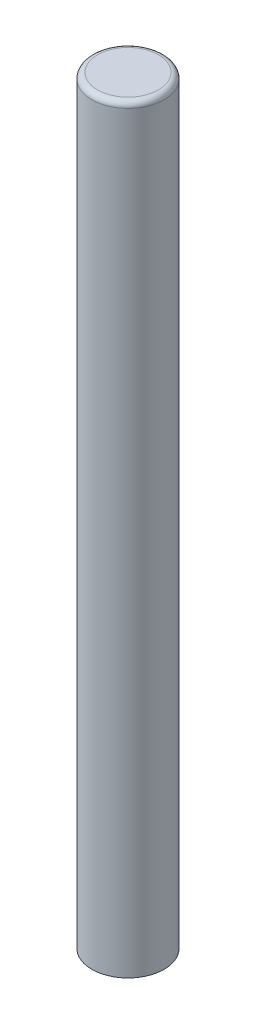
ISO-10303-21;
HEADER;
FILE_DESCRIPTION(('STEP AP214'),'2;1');
FILE_NAME('part.step','',(''),(''),'','','');
FILE_SCHEMA(('AUTOMOTIVE_DESIGN { 1 0 10303 214 1 1 1 1 }'));
ENDSEC;
DATA;
#1=APPLICATION_CONTEXT('core data for automotive mechanical design processes');
#2=APPLICATION_PROTOCOL_DEFINITION('international standard','automotive_design',2000,#1);
#3=PRODUCT_CONTEXT('',#1,'mechanical');
#4=PRODUCT('Part','Part','',(#3));
#5=PRODUCT_RELATED_PRODUCT_CATEGORY('part','',(#4));
#6=PRODUCT_DEFINITION_FORMATION('','',#4);
#7=PRODUCT_DEFINITION_CONTEXT('part definition',#1,'design');
#8=PRODUCT_DEFINITION('design','',#6,#7);
#9=PRODUCT_DEFINITION_SHAPE('','',#8);
#10=(LENGTH_UNIT() NAMED_UNIT(*) SI_UNIT(.MILLI.,.METRE.));
#11=(NAMED_UNIT(*) PLANE_ANGLE_UNIT() SI_UNIT($,.RADIAN.));
#12=(NAMED_UNIT(*) SI_UNIT($,.STERADIAN.) SOLID_ANGLE_UNIT());
#13=UNCERTAINTY_MEASURE_WITH_UNIT(LENGTH_MEASURE(1.E-05),#10,'distance_accuracy_value','');
#14=(GEOMETRIC_REPRESENTATION_CONTEXT(3) GLOBAL_UNCERTAINTY_ASSIGNED_CONTEXT((#13)) GLOBAL_UNIT_ASSIGNED_CONTEXT((#10,
#11,#12)) REPRESENTATION_CONTEXT('',''));
#15=CARTESIAN_POINT('',(0.,0.,0.));
#16=DIRECTION('',(0.,0.,1.));
#17=DIRECTION('',(1.,0.,0.));
#18=AXIS2_PLACEMENT_3D('',#15,#16,#17);
#19=CARTESIAN_POINT('',(0.,200.,0.));
#20=DIRECTION('',(0.,-1.,0.));
#21=DIRECTION('',(0.,0.,-1.));
#22=AXIS2_PLACEMENT_3D('',#19,#20,#21);
#23=CYLINDRICAL_SURFACE('',#22,9.525);
#24=CARTESIAN_POINT('',(0.,198.5,0.));
#25=DIRECTION('',(0.,1.,0.));
#26=DIRECTION('',(0.,0.,1.));
#27=AXIS2_PLACEMENT_3D('',#24,#25,#26);
#28=CIRCLE('',#27,9.525);
#29=CARTESIAN_POINT('',(0.,198.5,9.525));
#30=VERTEX_POINT('',#29);
#31=EDGE_CURVE('E10',#30,#30,#28,.F.);
#32=ORIENTED_EDGE('',*,*,#31,.T.);
#33=EDGE_LOOP('',(#32));
#34=FACE_BOUND('',#33,.T.);
#35=CARTESIAN_POINT('',(0.,0.,0.));
#36=DIRECTION('',(0.,1.,0.));
#37=DIRECTION('',(0.,0.,1.));
#38=AXIS2_PLACEMENT_3D('',#35,#36,#37);
#39=CIRCLE('',#38,9.525);
#40=CARTESIAN_POINT('',(0.,0.,9.525));
#41=VERTEX_POINT('',#40);
#42=EDGE_CURVE('E43',#41,#41,#39,.T.);
#43=ORIENTED_EDGE('',*,*,#42,.T.);
#44=EDGE_LOOP('',(#43));
#45=FACE_BOUND('',#44,.T.);
#46=ADVANCED_FACE('F32',(#34,#45),#23,.T.);
#47=CARTESIAN_POINT('',(0.,200.,0.));
#48=DIRECTION('',(0.,1.,0.));
#49=DIRECTION('',(0.,0.,1.));
#50=AXIS2_PLACEMENT_3D('',#47,#48,#49);
#51=PLANE('',#50);
#52=CARTESIAN_POINT('',(0.,200.,0.));
#53=DIRECTION('',(0.,1.,0.));
#54=DIRECTION('',(0.,0.,1.));
#55=AXIS2_PLACEMENT_3D('',#52,#53,#54);
#56=CIRCLE('',#55,8.025);
#57=CARTESIAN_POINT('',(0.,200.,8.025));
#58=VERTEX_POINT('',#57);
#59=EDGE_CURVE('E39',#58,#58,#56,.T.);
#60=ORIENTED_EDGE('',*,*,#59,.T.);
#61=EDGE_LOOP('',(#60));
#62=FACE_BOUND('',#61,.T.);
#63=ADVANCED_FACE('F53',(#62),#51,.T.);
#64=CARTESIAN_POINT('',(0.,0.,0.));
#65=DIRECTION('',(0.,1.,0.));
#66=DIRECTION('',(0.,0.,1.));
#67=AXIS2_PLACEMENT_3D('',#64,#65,#66);
#68=PLANE('',#67);
#69=ORIENTED_EDGE('',*,*,#42,.F.);
#70=EDGE_LOOP('',(#69));
#71=FACE_BOUND('',#70,.T.);
#72=ADVANCED_FACE('F51',(#71),#68,.F.);
#73=CARTESIAN_POINT('',(0.,198.5,0.));
#74=DIRECTION('',(0.,1.,0.));
#75=DIRECTION('',(0.,0.,1.));
#76=AXIS2_PLACEMENT_3D('',#73,#74,#75);
#77=TOROIDAL_SURFACE('',#76,8.025,1.5);
#78=ORIENTED_EDGE('',*,*,#31,.F.);
#79=EDGE_LOOP('',(#78));
#80=FACE_BOUND('',#79,.T.);
#81=ORIENTED_EDGE('',*,*,#59,.F.);
#82=EDGE_LOOP('',(#81));
#83=FACE_BOUND('',#82,.T.);
#84=ADVANCED_FACE('F34',(#80,#83),#77,.T.);
#85=CLOSED_SHELL('',(#46,#63,#72,#84));
#86=MANIFOLD_SOLID_BREP('B2',#85);
#87=ADVANCED_BREP_SHAPE_REPRESENTATION('',(#18,#86),#14);
#88=SHAPE_DEFINITION_REPRESENTATION(#9,#87);
ENDSEC;
END-ISO-10303-21;
